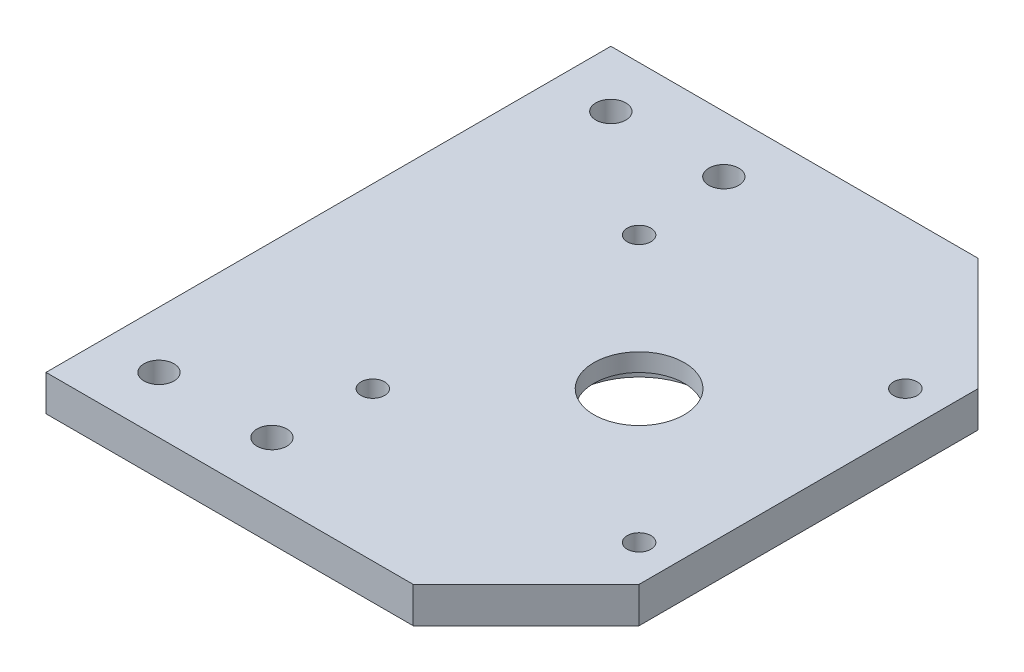
ISO-10303-21;
HEADER;
FILE_DESCRIPTION(('STEP AP214'),'2;1');
FILE_NAME('part.step','',(''),(''),'','','');
FILE_SCHEMA(('AUTOMOTIVE_DESIGN { 1 0 10303 214 1 1 1 1 }'));
ENDSEC;
DATA;
#1=APPLICATION_CONTEXT('core data for automotive mechanical design processes');
#2=APPLICATION_PROTOCOL_DEFINITION('international standard','automotive_design',2000,#1);
#3=PRODUCT_CONTEXT('',#1,'mechanical');
#4=PRODUCT('Part','Part','',(#3));
#5=PRODUCT_RELATED_PRODUCT_CATEGORY('part','',(#4));
#6=PRODUCT_DEFINITION_FORMATION('','',#4);
#7=PRODUCT_DEFINITION_CONTEXT('part definition',#1,'design');
#8=PRODUCT_DEFINITION('design','',#6,#7);
#9=PRODUCT_DEFINITION_SHAPE('','',#8);
#10=(LENGTH_UNIT() NAMED_UNIT(*) SI_UNIT(.MILLI.,.METRE.));
#11=(NAMED_UNIT(*) PLANE_ANGLE_UNIT() SI_UNIT($,.RADIAN.));
#12=(NAMED_UNIT(*) SI_UNIT($,.STERADIAN.) SOLID_ANGLE_UNIT());
#13=UNCERTAINTY_MEASURE_WITH_UNIT(LENGTH_MEASURE(1.E-05),#10,'distance_accuracy_value','');
#14=(GEOMETRIC_REPRESENTATION_CONTEXT(3) GLOBAL_UNCERTAINTY_ASSIGNED_CONTEXT((#13)) GLOBAL_UNIT_ASSIGNED_CONTEXT((#10,
#11,#12)) REPRESENTATION_CONTEXT('',''));
#15=CARTESIAN_POINT('',(0.,0.,0.));
#16=DIRECTION('',(0.,0.,1.));
#17=DIRECTION('',(1.,0.,0.));
#18=AXIS2_PLACEMENT_3D('',#15,#16,#17);
#19=CARTESIAN_POINT('',(65.,6.35,100.));
#20=DIRECTION('',(0.,0.,1.));
#21=DIRECTION('',(1.,0.,0.));
#22=AXIS2_PLACEMENT_3D('',#19,#20,#21);
#23=PLANE('',#22);
#24=DIRECTION('',(-1.,0.,0.));
#25=VECTOR('',#24,1.);
#26=CARTESIAN_POINT('',(65.,0.,100.));
#27=LINE('',#26,#25);
#28=CARTESIAN_POINT('',(65.,0.,100.));
#29=VERTEX_POINT('',#28);
#30=CARTESIAN_POINT('',(0.,0.,100.));
#31=VERTEX_POINT('',#30);
#32=EDGE_CURVE('E119',#29,#31,#27,.T.);
#33=ORIENTED_EDGE('',*,*,#32,.F.);
#34=DIRECTION('',(0.,-1.,0.));
#35=VECTOR('',#34,1.);
#36=CARTESIAN_POINT('',(65.,6.35,100.));
#37=LINE('',#36,#35);
#38=CARTESIAN_POINT('',(65.,6.35,100.));
#39=VERTEX_POINT('',#38);
#40=EDGE_CURVE('E11',#39,#29,#37,.T.);
#41=ORIENTED_EDGE('',*,*,#40,.F.);
#42=DIRECTION('',(-1.,0.,0.));
#43=VECTOR('',#42,1.);
#44=CARTESIAN_POINT('',(65.,6.35,100.));
#45=LINE('',#44,#43);
#46=CARTESIAN_POINT('',(0.,6.35,100.));
#47=VERTEX_POINT('',#46);
#48=EDGE_CURVE('E134',#39,#47,#45,.T.);
#49=ORIENTED_EDGE('',*,*,#48,.T.);
#50=DIRECTION('',(0.,-1.,0.));
#51=VECTOR('',#50,1.);
#52=CARTESIAN_POINT('',(0.,6.35,100.));
#53=LINE('',#52,#51);
#54=EDGE_CURVE('E37',#47,#31,#53,.T.);
#55=ORIENTED_EDGE('',*,*,#54,.T.);
#56=EDGE_LOOP('',(#33,#41,#49,#55));
#57=FACE_BOUND('',#56,.T.);
#58=ADVANCED_FACE('F34',(#57),#23,.T.);
#59=CARTESIAN_POINT('',(85.,6.35,80.));
#60=DIRECTION('',(0.707106781186547,0.,0.707106781186548));
#61=DIRECTION('',(0.707106781186548,0.,-0.707106781186547));
#62=AXIS2_PLACEMENT_3D('',#59,#60,#61);
#63=PLANE('',#62);
#64=DIRECTION('',(-0.707106781186549,0.,0.707106781186547));
#65=VECTOR('',#64,1.);
#66=CARTESIAN_POINT('',(85.,0.,80.));
#67=LINE('',#66,#65);
#68=CARTESIAN_POINT('',(85.,0.,80.));
#69=VERTEX_POINT('',#68);
#70=EDGE_CURVE('E132',#69,#29,#67,.T.);
#71=ORIENTED_EDGE('',*,*,#70,.F.);
#72=DIRECTION('',(0.,-1.,0.));
#73=VECTOR('',#72,1.);
#74=CARTESIAN_POINT('',(85.,6.35,80.));
#75=LINE('',#74,#73);
#76=CARTESIAN_POINT('',(85.,6.35,80.));
#77=VERTEX_POINT('',#76);
#78=EDGE_CURVE('E43',#77,#69,#75,.T.);
#79=ORIENTED_EDGE('',*,*,#78,.F.);
#80=DIRECTION('',(-0.707106781186549,0.,0.707106781186547));
#81=VECTOR('',#80,1.);
#82=CARTESIAN_POINT('',(85.,6.35,80.));
#83=LINE('',#82,#81);
#84=EDGE_CURVE('E109',#77,#39,#83,.T.);
#85=ORIENTED_EDGE('',*,*,#84,.T.);
#86=ORIENTED_EDGE('',*,*,#40,.T.);
#87=EDGE_LOOP('',(#71,#79,#85,#86));
#88=FACE_BOUND('',#87,.T.);
#89=ADVANCED_FACE('F142',(#88),#63,.T.);
#90=CARTESIAN_POINT('',(85.,6.35,20.));
#91=DIRECTION('',(1.,0.,0.));
#92=DIRECTION('',(0.,0.,-1.));
#93=AXIS2_PLACEMENT_3D('',#90,#91,#92);
#94=PLANE('',#93);
#95=DIRECTION('',(0.,0.,1.));
#96=VECTOR('',#95,1.);
#97=CARTESIAN_POINT('',(85.,0.,20.));
#98=LINE('',#97,#96);
#99=CARTESIAN_POINT('',(85.,0.,20.));
#100=VERTEX_POINT('',#99);
#101=EDGE_CURVE('E96',#100,#69,#98,.T.);
#102=ORIENTED_EDGE('',*,*,#101,.F.);
#103=DIRECTION('',(0.,-1.,0.));
#104=VECTOR('',#103,1.);
#105=CARTESIAN_POINT('',(85.,6.35,20.));
#106=LINE('',#105,#104);
#107=CARTESIAN_POINT('',(85.,6.35,20.));
#108=VERTEX_POINT('',#107);
#109=EDGE_CURVE('E91',#108,#100,#106,.T.);
#110=ORIENTED_EDGE('',*,*,#109,.F.);
#111=DIRECTION('',(0.,0.,1.));
#112=VECTOR('',#111,1.);
#113=CARTESIAN_POINT('',(85.,6.35,20.));
#114=LINE('',#113,#112);
#115=EDGE_CURVE('E94',#108,#77,#114,.T.);
#116=ORIENTED_EDGE('',*,*,#115,.T.);
#117=ORIENTED_EDGE('',*,*,#78,.T.);
#118=EDGE_LOOP('',(#102,#110,#116,#117));
#119=FACE_BOUND('',#118,.T.);
#120=ADVANCED_FACE('F93',(#119),#94,.T.);
#121=CARTESIAN_POINT('',(65.,6.35,0.));
#122=DIRECTION('',(0.707106781186547,0.,-0.707106781186548));
#123=DIRECTION('',(-0.707106781186548,0.,-0.707106781186547));
#124=AXIS2_PLACEMENT_3D('',#121,#122,#123);
#125=PLANE('',#124);
#126=DIRECTION('',(0.707106781186548,0.,0.707106781186547));
#127=VECTOR('',#126,1.);
#128=CARTESIAN_POINT('',(65.,0.,0.));
#129=LINE('',#128,#127);
#130=CARTESIAN_POINT('',(65.,0.,0.));
#131=VERTEX_POINT('',#130);
#132=EDGE_CURVE('E129',#131,#100,#129,.T.);
#133=ORIENTED_EDGE('',*,*,#132,.F.);
#134=DIRECTION('',(0.,-1.,0.));
#135=VECTOR('',#134,1.);
#136=CARTESIAN_POINT('',(65.,6.35,0.));
#137=LINE('',#136,#135);
#138=CARTESIAN_POINT('',(65.,6.35,0.));
#139=VERTEX_POINT('',#138);
#140=EDGE_CURVE('E101',#139,#131,#137,.T.);
#141=ORIENTED_EDGE('',*,*,#140,.F.);
#142=DIRECTION('',(0.707106781186548,0.,0.707106781186547));
#143=VECTOR('',#142,1.);
#144=CARTESIAN_POINT('',(65.,6.35,0.));
#145=LINE('',#144,#143);
#146=EDGE_CURVE('E107',#139,#108,#145,.T.);
#147=ORIENTED_EDGE('',*,*,#146,.T.);
#148=ORIENTED_EDGE('',*,*,#109,.T.);
#149=EDGE_LOOP('',(#133,#141,#147,#148));
#150=FACE_BOUND('',#149,.T.);
#151=ADVANCED_FACE('F111',(#150),#125,.T.);
#152=CARTESIAN_POINT('',(0.,6.35,0.));
#153=DIRECTION('',(0.,0.,-1.));
#154=DIRECTION('',(-1.,0.,0.));
#155=AXIS2_PLACEMENT_3D('',#152,#153,#154);
#156=PLANE('',#155);
#157=DIRECTION('',(1.,0.,0.));
#158=VECTOR('',#157,1.);
#159=CARTESIAN_POINT('',(0.,0.,0.));
#160=LINE('',#159,#158);
#161=CARTESIAN_POINT('',(0.,0.,0.));
#162=VERTEX_POINT('',#161);
#163=EDGE_CURVE('E126',#162,#131,#160,.T.);
#164=ORIENTED_EDGE('',*,*,#163,.F.);
#165=DIRECTION('',(0.,-1.,0.));
#166=VECTOR('',#165,1.);
#167=CARTESIAN_POINT('',(0.,6.35,0.));
#168=LINE('',#167,#166);
#169=CARTESIAN_POINT('',(0.,6.35,0.));
#170=VERTEX_POINT('',#169);
#171=EDGE_CURVE('E137',#170,#162,#168,.T.);
#172=ORIENTED_EDGE('',*,*,#171,.F.);
#173=DIRECTION('',(1.,0.,0.));
#174=VECTOR('',#173,1.);
#175=CARTESIAN_POINT('',(0.,6.35,0.));
#176=LINE('',#175,#174);
#177=EDGE_CURVE('E112',#170,#139,#176,.T.);
#178=ORIENTED_EDGE('',*,*,#177,.T.);
#179=ORIENTED_EDGE('',*,*,#140,.T.);
#180=EDGE_LOOP('',(#164,#172,#178,#179));
#181=FACE_BOUND('',#180,.T.);
#182=ADVANCED_FACE('F155',(#181),#156,.T.);
#183=CARTESIAN_POINT('',(0.,6.35,100.));
#184=DIRECTION('',(-1.,0.,0.));
#185=DIRECTION('',(0.,0.,1.));
#186=AXIS2_PLACEMENT_3D('',#183,#184,#185);
#187=PLANE('',#186);
#188=DIRECTION('',(0.,0.,-1.));
#189=VECTOR('',#188,1.);
#190=CARTESIAN_POINT('',(0.,0.,100.));
#191=LINE('',#190,#189);
#192=EDGE_CURVE('E122',#31,#162,#191,.T.);
#193=ORIENTED_EDGE('',*,*,#192,.F.);
#194=ORIENTED_EDGE('',*,*,#54,.F.);
#195=DIRECTION('',(0.,0.,-1.));
#196=VECTOR('',#195,1.);
#197=CARTESIAN_POINT('',(0.,6.35,100.));
#198=LINE('',#197,#196);
#199=EDGE_CURVE('E114',#47,#170,#198,.T.);
#200=ORIENTED_EDGE('',*,*,#199,.T.);
#201=ORIENTED_EDGE('',*,*,#171,.T.);
#202=EDGE_LOOP('',(#193,#194,#200,#201));
#203=FACE_BOUND('',#202,.T.);
#204=ADVANCED_FACE('F139',(#203),#187,.T.);
#205=CARTESIAN_POINT('',(0.,6.35,0.));
#206=DIRECTION('',(0.,-1.,0.));
#207=DIRECTION('',(0.,0.,-1.));
#208=AXIS2_PLACEMENT_3D('',#205,#206,#207);
#209=PLANE('',#208);
#210=CARTESIAN_POINT('',(55.,6.35,50.));
#211=DIRECTION('',(0.,-1.,0.));
#212=DIRECTION('',(0.,0.,-1.));
#213=AXIS2_PLACEMENT_3D('',#210,#211,#212);
#214=CIRCLE('',#213,8.);
#215=CARTESIAN_POINT('',(55.,6.35,42.));
#216=VERTEX_POINT('',#215);
#217=EDGE_CURVE('E220',#216,#216,#214,.T.);
#218=ORIENTED_EDGE('',*,*,#217,.T.);
#219=EDGE_LOOP('',(#218));
#220=FACE_BOUND('',#219,.T.);
#221=CARTESIAN_POINT('',(10.,6.35,10.));
#222=DIRECTION('',(0.,1.,0.));
#223=DIRECTION('',(0.,0.,1.));
#224=AXIS2_PLACEMENT_3D('',#221,#222,#223);
#225=CIRCLE('',#224,2.65);
#226=CARTESIAN_POINT('',(10.,6.35,12.65));
#227=VERTEX_POINT('',#226);
#228=EDGE_CURVE('E229',#227,#227,#225,.T.);
#229=ORIENTED_EDGE('',*,*,#228,.F.);
#230=EDGE_LOOP('',(#229));
#231=FACE_BOUND('',#230,.T.);
#232=CARTESIAN_POINT('',(30.,6.35,10.));
#233=DIRECTION('',(0.,1.,0.));
#234=DIRECTION('',(0.,0.,1.));
#235=AXIS2_PLACEMENT_3D('',#232,#233,#234);
#236=CIRCLE('',#235,2.65);
#237=CARTESIAN_POINT('',(30.,6.35,12.65));
#238=VERTEX_POINT('',#237);
#239=EDGE_CURVE('E236',#238,#238,#236,.T.);
#240=ORIENTED_EDGE('',*,*,#239,.F.);
#241=EDGE_LOOP('',(#240));
#242=FACE_BOUND('',#241,.T.);
#243=CARTESIAN_POINT('',(10.,6.35,90.));
#244=DIRECTION('',(0.,1.,0.));
#245=DIRECTION('',(0.,0.,1.));
#246=AXIS2_PLACEMENT_3D('',#243,#244,#245);
#247=CIRCLE('',#246,2.65);
#248=CARTESIAN_POINT('',(10.,6.35,92.65));
#249=VERTEX_POINT('',#248);
#250=EDGE_CURVE('E242',#249,#249,#247,.T.);
#251=ORIENTED_EDGE('',*,*,#250,.F.);
#252=EDGE_LOOP('',(#251));
#253=FACE_BOUND('',#252,.T.);
#254=CARTESIAN_POINT('',(30.,6.35,90.));
#255=DIRECTION('',(0.,1.,0.));
#256=DIRECTION('',(0.,0.,1.));
#257=AXIS2_PLACEMENT_3D('',#254,#255,#256);
#258=CIRCLE('',#257,2.65);
#259=CARTESIAN_POINT('',(30.,6.35,92.65));
#260=VERTEX_POINT('',#259);
#261=EDGE_CURVE('E248',#260,#260,#258,.T.);
#262=ORIENTED_EDGE('',*,*,#261,.F.);
#263=EDGE_LOOP('',(#262));
#264=FACE_BOUND('',#263,.T.);
#265=CARTESIAN_POINT('',(78.57,6.35,26.43));
#266=DIRECTION('',(0.,1.,0.));
#267=DIRECTION('',(0.,0.,1.));
#268=AXIS2_PLACEMENT_3D('',#265,#266,#267);
#269=CIRCLE('',#268,2.1);
#270=CARTESIAN_POINT('',(78.57,6.35,28.53));
#271=VERTEX_POINT('',#270);
#272=EDGE_CURVE('E254',#271,#271,#269,.T.);
#273=ORIENTED_EDGE('',*,*,#272,.F.);
#274=EDGE_LOOP('',(#273));
#275=FACE_BOUND('',#274,.T.);
#276=CARTESIAN_POINT('',(31.43,6.35,26.43));
#277=DIRECTION('',(0.,1.,0.));
#278=DIRECTION('',(0.,0.,1.));
#279=AXIS2_PLACEMENT_3D('',#276,#277,#278);
#280=CIRCLE('',#279,2.1);
#281=CARTESIAN_POINT('',(31.43,6.35,28.53));
#282=VERTEX_POINT('',#281);
#283=EDGE_CURVE('E260',#282,#282,#280,.T.);
#284=ORIENTED_EDGE('',*,*,#283,.F.);
#285=EDGE_LOOP('',(#284));
#286=FACE_BOUND('',#285,.T.);
#287=CARTESIAN_POINT('',(31.43,6.35,73.57));
#288=DIRECTION('',(0.,1.,0.));
#289=DIRECTION('',(0.,0.,1.));
#290=AXIS2_PLACEMENT_3D('',#287,#288,#289);
#291=CIRCLE('',#290,2.1);
#292=CARTESIAN_POINT('',(31.43,6.35,75.67));
#293=VERTEX_POINT('',#292);
#294=EDGE_CURVE('E266',#293,#293,#291,.T.);
#295=ORIENTED_EDGE('',*,*,#294,.F.);
#296=EDGE_LOOP('',(#295));
#297=FACE_BOUND('',#296,.T.);
#298=CARTESIAN_POINT('',(78.57,6.35,73.57));
#299=DIRECTION('',(0.,1.,0.));
#300=DIRECTION('',(0.,0.,1.));
#301=AXIS2_PLACEMENT_3D('',#298,#299,#300);
#302=CIRCLE('',#301,2.1);
#303=CARTESIAN_POINT('',(78.57,6.35,75.67));
#304=VERTEX_POINT('',#303);
#305=EDGE_CURVE('E272',#304,#304,#302,.T.);
#306=ORIENTED_EDGE('',*,*,#305,.F.);
#307=EDGE_LOOP('',(#306));
#308=FACE_BOUND('',#307,.T.);
#309=ORIENTED_EDGE('',*,*,#48,.F.);
#310=ORIENTED_EDGE('',*,*,#84,.F.);
#311=ORIENTED_EDGE('',*,*,#115,.F.);
#312=ORIENTED_EDGE('',*,*,#146,.F.);
#313=ORIENTED_EDGE('',*,*,#177,.F.);
#314=ORIENTED_EDGE('',*,*,#199,.F.);
#315=EDGE_LOOP('',(#309,#310,#311,#312,#313,#314));
#316=FACE_BOUND('',#315,.T.);
#317=ADVANCED_FACE('F105',(#220,#231,#242,#253,#264,#275,#286,#297,#308,#316),#209,.F.);
#318=CARTESIAN_POINT('',(0.,0.,0.));
#319=DIRECTION('',(0.,-1.,0.));
#320=DIRECTION('',(0.,0.,-1.));
#321=AXIS2_PLACEMENT_3D('',#318,#319,#320);
#322=PLANE('',#321);
#323=CARTESIAN_POINT('',(55.,0.,50.));
#324=DIRECTION('',(0.,1.,0.));
#325=DIRECTION('',(0.,0.,1.));
#326=AXIS2_PLACEMENT_3D('',#323,#324,#325);
#327=CIRCLE('',#326,11.5);
#328=CARTESIAN_POINT('',(55.,0.,61.5));
#329=VERTEX_POINT('',#328);
#330=EDGE_CURVE('E221',#329,#329,#327,.T.);
#331=ORIENTED_EDGE('',*,*,#330,.T.);
#332=EDGE_LOOP('',(#331));
#333=FACE_BOUND('',#332,.T.);
#334=CARTESIAN_POINT('',(10.,0.,10.));
#335=DIRECTION('',(0.,1.,0.));
#336=DIRECTION('',(0.,0.,1.));
#337=AXIS2_PLACEMENT_3D('',#334,#335,#336);
#338=CIRCLE('',#337,2.65);
#339=CARTESIAN_POINT('',(10.,0.,12.65));
#340=VERTEX_POINT('',#339);
#341=EDGE_CURVE('E233',#340,#340,#338,.T.);
#342=ORIENTED_EDGE('',*,*,#341,.T.);
#343=EDGE_LOOP('',(#342));
#344=FACE_BOUND('',#343,.T.);
#345=CARTESIAN_POINT('',(30.,0.,10.));
#346=DIRECTION('',(0.,1.,0.));
#347=DIRECTION('',(0.,0.,1.));
#348=AXIS2_PLACEMENT_3D('',#345,#346,#347);
#349=CIRCLE('',#348,2.65);
#350=CARTESIAN_POINT('',(30.,0.,12.65));
#351=VERTEX_POINT('',#350);
#352=EDGE_CURVE('E239',#351,#351,#349,.T.);
#353=ORIENTED_EDGE('',*,*,#352,.T.);
#354=EDGE_LOOP('',(#353));
#355=FACE_BOUND('',#354,.T.);
#356=CARTESIAN_POINT('',(10.,0.,90.));
#357=DIRECTION('',(0.,1.,0.));
#358=DIRECTION('',(0.,0.,1.));
#359=AXIS2_PLACEMENT_3D('',#356,#357,#358);
#360=CIRCLE('',#359,2.65);
#361=CARTESIAN_POINT('',(10.,0.,92.65));
#362=VERTEX_POINT('',#361);
#363=EDGE_CURVE('E245',#362,#362,#360,.T.);
#364=ORIENTED_EDGE('',*,*,#363,.T.);
#365=EDGE_LOOP('',(#364));
#366=FACE_BOUND('',#365,.T.);
#367=CARTESIAN_POINT('',(30.,0.,90.));
#368=DIRECTION('',(0.,1.,0.));
#369=DIRECTION('',(0.,0.,1.));
#370=AXIS2_PLACEMENT_3D('',#367,#368,#369);
#371=CIRCLE('',#370,2.65);
#372=CARTESIAN_POINT('',(30.,0.,92.65));
#373=VERTEX_POINT('',#372);
#374=EDGE_CURVE('E251',#373,#373,#371,.T.);
#375=ORIENTED_EDGE('',*,*,#374,.T.);
#376=EDGE_LOOP('',(#375));
#377=FACE_BOUND('',#376,.T.);
#378=CARTESIAN_POINT('',(78.57,0.,26.43));
#379=DIRECTION('',(0.,1.,0.));
#380=DIRECTION('',(0.,0.,1.));
#381=AXIS2_PLACEMENT_3D('',#378,#379,#380);
#382=CIRCLE('',#381,2.1);
#383=CARTESIAN_POINT('',(78.57,0.,28.53));
#384=VERTEX_POINT('',#383);
#385=EDGE_CURVE('E257',#384,#384,#382,.T.);
#386=ORIENTED_EDGE('',*,*,#385,.T.);
#387=EDGE_LOOP('',(#386));
#388=FACE_BOUND('',#387,.T.);
#389=CARTESIAN_POINT('',(31.43,0.,26.43));
#390=DIRECTION('',(0.,1.,0.));
#391=DIRECTION('',(0.,0.,1.));
#392=AXIS2_PLACEMENT_3D('',#389,#390,#391);
#393=CIRCLE('',#392,2.1);
#394=CARTESIAN_POINT('',(31.43,0.,28.53));
#395=VERTEX_POINT('',#394);
#396=EDGE_CURVE('E263',#395,#395,#393,.T.);
#397=ORIENTED_EDGE('',*,*,#396,.T.);
#398=EDGE_LOOP('',(#397));
#399=FACE_BOUND('',#398,.T.);
#400=CARTESIAN_POINT('',(31.43,0.,73.57));
#401=DIRECTION('',(0.,1.,0.));
#402=DIRECTION('',(0.,0.,1.));
#403=AXIS2_PLACEMENT_3D('',#400,#401,#402);
#404=CIRCLE('',#403,2.1);
#405=CARTESIAN_POINT('',(31.43,0.,75.67));
#406=VERTEX_POINT('',#405);
#407=EDGE_CURVE('E269',#406,#406,#404,.T.);
#408=ORIENTED_EDGE('',*,*,#407,.T.);
#409=EDGE_LOOP('',(#408));
#410=FACE_BOUND('',#409,.T.);
#411=CARTESIAN_POINT('',(78.57,0.,73.57));
#412=DIRECTION('',(0.,1.,0.));
#413=DIRECTION('',(0.,0.,1.));
#414=AXIS2_PLACEMENT_3D('',#411,#412,#413);
#415=CIRCLE('',#414,2.1);
#416=CARTESIAN_POINT('',(78.57,0.,75.67));
#417=VERTEX_POINT('',#416);
#418=EDGE_CURVE('E123',#417,#417,#415,.T.);
#419=ORIENTED_EDGE('',*,*,#418,.T.);
#420=EDGE_LOOP('',(#419));
#421=FACE_BOUND('',#420,.T.);
#422=ORIENTED_EDGE('',*,*,#32,.T.);
#423=ORIENTED_EDGE('',*,*,#192,.T.);
#424=ORIENTED_EDGE('',*,*,#163,.T.);
#425=ORIENTED_EDGE('',*,*,#132,.T.);
#426=ORIENTED_EDGE('',*,*,#101,.T.);
#427=ORIENTED_EDGE('',*,*,#70,.T.);
#428=EDGE_LOOP('',(#422,#423,#424,#425,#426,#427));
#429=FACE_BOUND('',#428,.T.);
#430=ADVANCED_FACE('F141',(#333,#344,#355,#366,#377,#388,#399,#410,#421,#429),#322,.T.);
#431=CARTESIAN_POINT('',(78.57,6.35,73.57));
#432=DIRECTION('',(0.,1.,0.));
#433=DIRECTION('',(0.,0.,1.));
#434=AXIS2_PLACEMENT_3D('',#431,#432,#433);
#435=CYLINDRICAL_SURFACE('',#434,2.1);
#436=ORIENTED_EDGE('',*,*,#418,.F.);
#437=EDGE_LOOP('',(#436));
#438=FACE_BOUND('',#437,.T.);
#439=ORIENTED_EDGE('',*,*,#305,.T.);
#440=EDGE_LOOP('',(#439));
#441=FACE_BOUND('',#440,.T.);
#442=ADVANCED_FACE('F166',(#438,#441),#435,.F.);
#443=CARTESIAN_POINT('',(31.43,6.35,73.57));
#444=DIRECTION('',(0.,1.,0.));
#445=DIRECTION('',(0.,0.,1.));
#446=AXIS2_PLACEMENT_3D('',#443,#444,#445);
#447=CYLINDRICAL_SURFACE('',#446,2.1);
#448=ORIENTED_EDGE('',*,*,#407,.F.);
#449=EDGE_LOOP('',(#448));
#450=FACE_BOUND('',#449,.T.);
#451=ORIENTED_EDGE('',*,*,#294,.T.);
#452=EDGE_LOOP('',(#451));
#453=FACE_BOUND('',#452,.T.);
#454=ADVANCED_FACE('F173',(#450,#453),#447,.F.);
#455=CARTESIAN_POINT('',(31.43,6.35,26.43));
#456=DIRECTION('',(0.,1.,0.));
#457=DIRECTION('',(0.,0.,1.));
#458=AXIS2_PLACEMENT_3D('',#455,#456,#457);
#459=CYLINDRICAL_SURFACE('',#458,2.1);
#460=ORIENTED_EDGE('',*,*,#396,.F.);
#461=EDGE_LOOP('',(#460));
#462=FACE_BOUND('',#461,.T.);
#463=ORIENTED_EDGE('',*,*,#283,.T.);
#464=EDGE_LOOP('',(#463));
#465=FACE_BOUND('',#464,.T.);
#466=ADVANCED_FACE('F177',(#462,#465),#459,.F.);
#467=CARTESIAN_POINT('',(78.57,6.35,26.43));
#468=DIRECTION('',(0.,1.,0.));
#469=DIRECTION('',(0.,0.,1.));
#470=AXIS2_PLACEMENT_3D('',#467,#468,#469);
#471=CYLINDRICAL_SURFACE('',#470,2.1);
#472=ORIENTED_EDGE('',*,*,#385,.F.);
#473=EDGE_LOOP('',(#472));
#474=FACE_BOUND('',#473,.T.);
#475=ORIENTED_EDGE('',*,*,#272,.T.);
#476=EDGE_LOOP('',(#475));
#477=FACE_BOUND('',#476,.T.);
#478=ADVANCED_FACE('F181',(#474,#477),#471,.F.);
#479=CARTESIAN_POINT('',(30.,6.35,90.));
#480=DIRECTION('',(0.,1.,0.));
#481=DIRECTION('',(0.,0.,1.));
#482=AXIS2_PLACEMENT_3D('',#479,#480,#481);
#483=CYLINDRICAL_SURFACE('',#482,2.65);
#484=ORIENTED_EDGE('',*,*,#374,.F.);
#485=EDGE_LOOP('',(#484));
#486=FACE_BOUND('',#485,.T.);
#487=ORIENTED_EDGE('',*,*,#261,.T.);
#488=EDGE_LOOP('',(#487));
#489=FACE_BOUND('',#488,.T.);
#490=ADVANCED_FACE('F185',(#486,#489),#483,.F.);
#491=CARTESIAN_POINT('',(10.,6.35,90.));
#492=DIRECTION('',(0.,1.,0.));
#493=DIRECTION('',(0.,0.,1.));
#494=AXIS2_PLACEMENT_3D('',#491,#492,#493);
#495=CYLINDRICAL_SURFACE('',#494,2.65);
#496=ORIENTED_EDGE('',*,*,#363,.F.);
#497=EDGE_LOOP('',(#496));
#498=FACE_BOUND('',#497,.T.);
#499=ORIENTED_EDGE('',*,*,#250,.T.);
#500=EDGE_LOOP('',(#499));
#501=FACE_BOUND('',#500,.T.);
#502=ADVANCED_FACE('F189',(#498,#501),#495,.F.);
#503=CARTESIAN_POINT('',(30.,6.35,10.));
#504=DIRECTION('',(0.,1.,0.));
#505=DIRECTION('',(0.,0.,1.));
#506=AXIS2_PLACEMENT_3D('',#503,#504,#505);
#507=CYLINDRICAL_SURFACE('',#506,2.65);
#508=ORIENTED_EDGE('',*,*,#352,.F.);
#509=EDGE_LOOP('',(#508));
#510=FACE_BOUND('',#509,.T.);
#511=ORIENTED_EDGE('',*,*,#239,.T.);
#512=EDGE_LOOP('',(#511));
#513=FACE_BOUND('',#512,.T.);
#514=ADVANCED_FACE('F193',(#510,#513),#507,.F.);
#515=CARTESIAN_POINT('',(10.,6.35,10.));
#516=DIRECTION('',(0.,1.,0.));
#517=DIRECTION('',(0.,0.,1.));
#518=AXIS2_PLACEMENT_3D('',#515,#516,#517);
#519=CYLINDRICAL_SURFACE('',#518,2.65);
#520=ORIENTED_EDGE('',*,*,#341,.F.);
#521=EDGE_LOOP('',(#520));
#522=FACE_BOUND('',#521,.T.);
#523=ORIENTED_EDGE('',*,*,#228,.T.);
#524=EDGE_LOOP('',(#523));
#525=FACE_BOUND('',#524,.T.);
#526=ADVANCED_FACE('F197',(#522,#525),#519,.F.);
#527=CARTESIAN_POINT('',(55.,3.175,50.));
#528=DIRECTION('',(0.,-1.,0.));
#529=DIRECTION('',(0.,0.,-1.));
#530=AXIS2_PLACEMENT_3D('',#527,#528,#529);
#531=CYLINDRICAL_SURFACE('',#530,11.5);
#532=CARTESIAN_POINT('',(55.,3.175,50.));
#533=DIRECTION('',(0.,1.,0.));
#534=DIRECTION('',(0.,0.,1.));
#535=AXIS2_PLACEMENT_3D('',#532,#533,#534);
#536=CIRCLE('',#535,11.5);
#537=CARTESIAN_POINT('',(55.,3.175,61.5));
#538=VERTEX_POINT('',#537);
#539=EDGE_CURVE('E224',#538,#538,#536,.T.);
#540=ORIENTED_EDGE('',*,*,#539,.T.);
#541=EDGE_LOOP('',(#540));
#542=FACE_BOUND('',#541,.T.);
#543=ORIENTED_EDGE('',*,*,#330,.F.);
#544=EDGE_LOOP('',(#543));
#545=FACE_BOUND('',#544,.T.);
#546=ADVANCED_FACE('F201',(#542,#545),#531,.F.);
#547=CARTESIAN_POINT('',(55.,3.175,50.));
#548=DIRECTION('',(0.,1.,0.));
#549=DIRECTION('',(0.,0.,1.));
#550=AXIS2_PLACEMENT_3D('',#547,#548,#549);
#551=PLANE('',#550);
#552=CARTESIAN_POINT('',(55.,3.175,50.));
#553=DIRECTION('',(0.,-1.,0.));
#554=DIRECTION('',(0.,0.,-1.));
#555=AXIS2_PLACEMENT_3D('',#552,#553,#554);
#556=CIRCLE('',#555,8.);
#557=CARTESIAN_POINT('',(55.,3.175,42.));
#558=VERTEX_POINT('',#557);
#559=EDGE_CURVE('E218',#558,#558,#556,.T.);
#560=ORIENTED_EDGE('',*,*,#559,.F.);
#561=EDGE_LOOP('',(#560));
#562=FACE_BOUND('',#561,.T.);
#563=ORIENTED_EDGE('',*,*,#539,.F.);
#564=EDGE_LOOP('',(#563));
#565=FACE_BOUND('',#564,.T.);
#566=ADVANCED_FACE('F205',(#562,#565),#551,.F.);
#567=CARTESIAN_POINT('',(55.,13.175,50.));
#568=DIRECTION('',(0.,-1.,0.));
#569=DIRECTION('',(0.,0.,-1.));
#570=AXIS2_PLACEMENT_3D('',#567,#568,#569);
#571=CYLINDRICAL_SURFACE('',#570,8.);
#572=ORIENTED_EDGE('',*,*,#559,.T.);
#573=EDGE_LOOP('',(#572));
#574=FACE_BOUND('',#573,.T.);
#575=ORIENTED_EDGE('',*,*,#217,.F.);
#576=EDGE_LOOP('',(#575));
#577=FACE_BOUND('',#576,.T.);
#578=ADVANCED_FACE('F209',(#574,#577),#571,.F.);
#579=CLOSED_SHELL('',(#58,#89,#120,#151,#182,#204,#317,#430,#442,#454,#466,#478,#490,#502,#514,
#526,#546,#566,#578));
#580=MANIFOLD_SOLID_BREP('B2',#579);
#581=ADVANCED_BREP_SHAPE_REPRESENTATION('',(#18,#580),#14);
#582=SHAPE_DEFINITION_REPRESENTATION(#9,#581);
ENDSEC;
END-ISO-10303-21;
